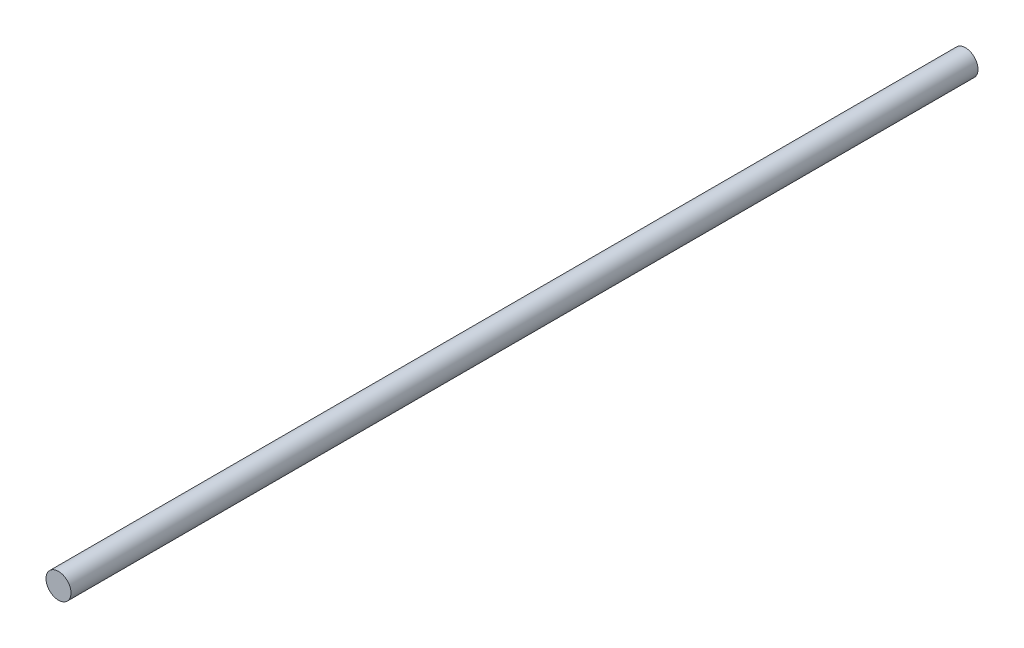
ISO-10303-21;
HEADER;
FILE_DESCRIPTION(('STEP AP214'),'2;1');
FILE_NAME('part.step','',(''),(''),'','','');
FILE_SCHEMA(('AUTOMOTIVE_DESIGN { 1 0 10303 214 1 1 1 1 }'));
ENDSEC;
DATA;
#1=APPLICATION_CONTEXT('core data for automotive mechanical design processes');
#2=APPLICATION_PROTOCOL_DEFINITION('international standard','automotive_design',2000,#1);
#3=PRODUCT_CONTEXT('',#1,'mechanical');
#4=PRODUCT('Part','Part','',(#3));
#5=PRODUCT_RELATED_PRODUCT_CATEGORY('part','',(#4));
#6=PRODUCT_DEFINITION_FORMATION('','',#4);
#7=PRODUCT_DEFINITION_CONTEXT('part definition',#1,'design');
#8=PRODUCT_DEFINITION('design','',#6,#7);
#9=PRODUCT_DEFINITION_SHAPE('','',#8);
#10=(LENGTH_UNIT() NAMED_UNIT(*) SI_UNIT(.MILLI.,.METRE.));
#11=(NAMED_UNIT(*) PLANE_ANGLE_UNIT() SI_UNIT($,.RADIAN.));
#12=(NAMED_UNIT(*) SI_UNIT($,.STERADIAN.) SOLID_ANGLE_UNIT());
#13=UNCERTAINTY_MEASURE_WITH_UNIT(LENGTH_MEASURE(1.E-05),#10,'distance_accuracy_value','');
#14=(GEOMETRIC_REPRESENTATION_CONTEXT(3) GLOBAL_UNCERTAINTY_ASSIGNED_CONTEXT((#13)) GLOBAL_UNIT_ASSIGNED_CONTEXT((#10,
#11,#12)) REPRESENTATION_CONTEXT('',''));
#15=CARTESIAN_POINT('',(0.,0.,0.));
#16=DIRECTION('',(0.,0.,1.));
#17=DIRECTION('',(1.,0.,0.));
#18=AXIS2_PLACEMENT_3D('',#15,#16,#17);
#19=CARTESIAN_POINT('',(0.,0.,290.));
#20=DIRECTION('',(0.,0.,-1.));
#21=DIRECTION('',(-1.,0.,0.));
#22=AXIS2_PLACEMENT_3D('',#19,#20,#21);
#23=CYLINDRICAL_SURFACE('',#22,4.);
#24=CARTESIAN_POINT('',(0.,0.,290.));
#25=DIRECTION('',(0.,0.,1.));
#26=DIRECTION('',(1.,0.,0.));
#27=AXIS2_PLACEMENT_3D('',#24,#25,#26);
#28=CIRCLE('',#27,4.);
#29=CARTESIAN_POINT('',(4.,0.,290.));
#30=VERTEX_POINT('',#29);
#31=EDGE_CURVE('E10',#30,#30,#28,.T.);
#32=ORIENTED_EDGE('',*,*,#31,.F.);
#33=EDGE_LOOP('',(#32));
#34=FACE_BOUND('',#33,.T.);
#35=CARTESIAN_POINT('',(0.,0.,0.));
#36=DIRECTION('',(0.,0.,1.));
#37=DIRECTION('',(1.,0.,0.));
#38=AXIS2_PLACEMENT_3D('',#35,#36,#37);
#39=CIRCLE('',#38,4.);
#40=CARTESIAN_POINT('',(4.,0.,0.));
#41=VERTEX_POINT('',#40);
#42=EDGE_CURVE('E38',#41,#41,#39,.T.);
#43=ORIENTED_EDGE('',*,*,#42,.T.);
#44=EDGE_LOOP('',(#43));
#45=FACE_BOUND('',#44,.T.);
#46=ADVANCED_FACE('F35',(#34,#45),#23,.T.);
#47=CARTESIAN_POINT('',(0.,0.,290.));
#48=DIRECTION('',(0.,0.,1.));
#49=DIRECTION('',(1.,0.,0.));
#50=AXIS2_PLACEMENT_3D('',#47,#48,#49);
#51=PLANE('',#50);
#52=ORIENTED_EDGE('',*,*,#31,.T.);
#53=EDGE_LOOP('',(#52));
#54=FACE_BOUND('',#53,.T.);
#55=ADVANCED_FACE('F50',(#54),#51,.T.);
#56=CARTESIAN_POINT('',(0.,0.,0.));
#57=DIRECTION('',(0.,0.,1.));
#58=DIRECTION('',(1.,0.,0.));
#59=AXIS2_PLACEMENT_3D('',#56,#57,#58);
#60=PLANE('',#59);
#61=ORIENTED_EDGE('',*,*,#42,.F.);
#62=EDGE_LOOP('',(#61));
#63=FACE_BOUND('',#62,.T.);
#64=ADVANCED_FACE('F48',(#63),#60,.F.);
#65=CLOSED_SHELL('',(#46,#55,#64));
#66=MANIFOLD_SOLID_BREP('B2',#65);
#67=ADVANCED_BREP_SHAPE_REPRESENTATION('',(#18,#66),#14);
#68=SHAPE_DEFINITION_REPRESENTATION(#9,#67);
ENDSEC;
END-ISO-10303-21;
